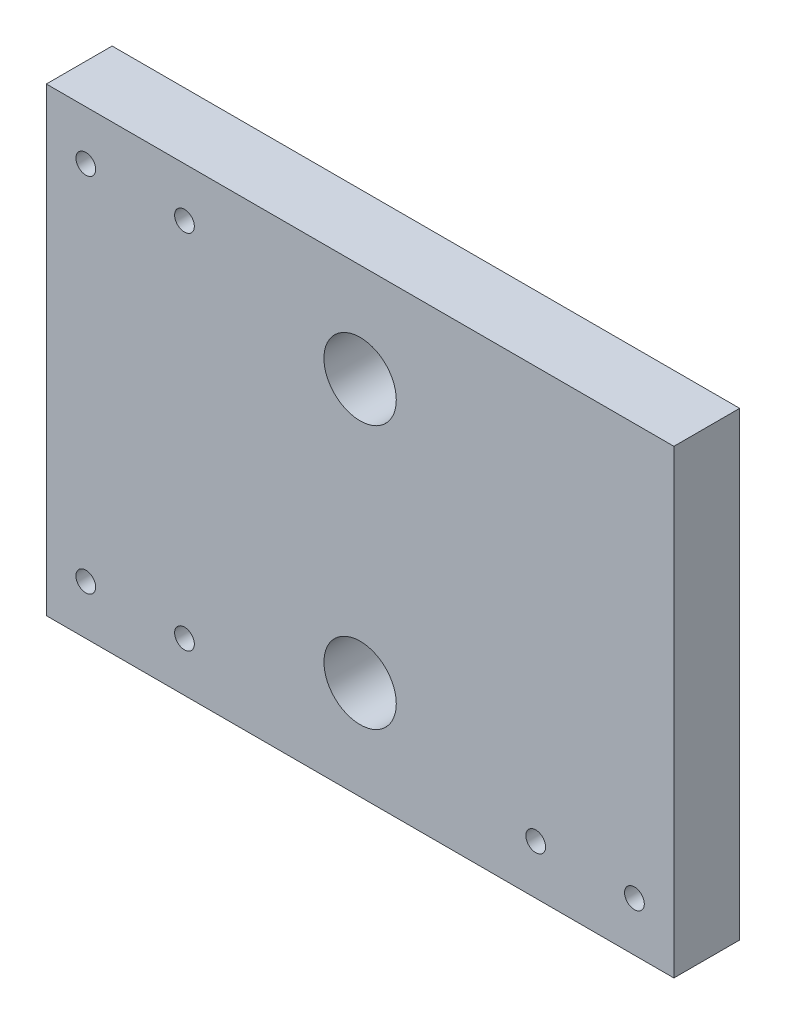
ISO-10303-21;
HEADER;
FILE_DESCRIPTION(('STEP AP214'),'2;1');
FILE_NAME('part.step','',(''),(''),'','','');
FILE_SCHEMA(('AUTOMOTIVE_DESIGN { 1 0 10303 214 1 1 1 1 }'));
ENDSEC;
DATA;
#1=APPLICATION_CONTEXT('core data for automotive mechanical design processes');
#2=APPLICATION_PROTOCOL_DEFINITION('international standard','automotive_design',2000,#1);
#3=PRODUCT_CONTEXT('',#1,'mechanical');
#4=PRODUCT('Part','Part','',(#3));
#5=PRODUCT_RELATED_PRODUCT_CATEGORY('part','',(#4));
#6=PRODUCT_DEFINITION_FORMATION('','',#4);
#7=PRODUCT_DEFINITION_CONTEXT('part definition',#1,'design');
#8=PRODUCT_DEFINITION('design','',#6,#7);
#9=PRODUCT_DEFINITION_SHAPE('','',#8);
#10=(LENGTH_UNIT() NAMED_UNIT(*) SI_UNIT(.MILLI.,.METRE.));
#11=(NAMED_UNIT(*) PLANE_ANGLE_UNIT() SI_UNIT($,.RADIAN.));
#12=(NAMED_UNIT(*) SI_UNIT($,.STERADIAN.) SOLID_ANGLE_UNIT());
#13=UNCERTAINTY_MEASURE_WITH_UNIT(LENGTH_MEASURE(1.E-05),#10,'distance_accuracy_value','');
#14=(GEOMETRIC_REPRESENTATION_CONTEXT(3) GLOBAL_UNCERTAINTY_ASSIGNED_CONTEXT((#13)) GLOBAL_UNIT_ASSIGNED_CONTEXT((#10,
#11,#12)) REPRESENTATION_CONTEXT('',''));
#15=CARTESIAN_POINT('',(0.,0.,0.));
#16=DIRECTION('',(0.,0.,1.));
#17=DIRECTION('',(1.,0.,0.));
#18=AXIS2_PLACEMENT_3D('',#15,#16,#17);
#19=CARTESIAN_POINT('',(0.,0.,10.));
#20=DIRECTION('',(0.,0.,-1.));
#21=DIRECTION('',(-1.,0.,0.));
#22=AXIS2_PLACEMENT_3D('',#19,#20,#21);
#23=CYLINDRICAL_SURFACE('',#22,7.9375);
#24=CARTESIAN_POINT('',(0.,0.,0.));
#25=DIRECTION('',(0.,0.,1.));
#26=DIRECTION('',(1.,0.,0.));
#27=AXIS2_PLACEMENT_3D('',#24,#25,#26);
#28=CIRCLE('',#27,7.9375);
#29=CARTESIAN_POINT('',(7.9375,0.,0.));
#30=VERTEX_POINT('',#29);
#31=EDGE_CURVE('E103',#30,#30,#28,.T.);
#32=ORIENTED_EDGE('',*,*,#31,.F.);
#33=EDGE_LOOP('',(#32));
#34=FACE_BOUND('',#33,.T.);
#35=CARTESIAN_POINT('',(0.,0.,2.));
#36=DIRECTION('',(0.,0.,1.));
#37=DIRECTION('',(1.,0.,0.));
#38=AXIS2_PLACEMENT_3D('',#35,#36,#37);
#39=CIRCLE('',#38,7.9375);
#40=CARTESIAN_POINT('',(7.9375,0.,2.));
#41=VERTEX_POINT('',#40);
#42=EDGE_CURVE('E320',#41,#41,#39,.T.);
#43=ORIENTED_EDGE('',*,*,#42,.T.);
#44=EDGE_LOOP('',(#43));
#45=FACE_BOUND('',#44,.T.);
#46=ADVANCED_FACE('F33',(#34,#45),#23,.F.);
#47=CARTESIAN_POINT('',(0.,40.,10.));
#48=DIRECTION('',(0.,0.,-1.));
#49=DIRECTION('',(-1.,0.,0.));
#50=AXIS2_PLACEMENT_3D('',#47,#48,#49);
#51=CYLINDRICAL_SURFACE('',#50,7.9375);
#52=CARTESIAN_POINT('',(0.,40.,0.));
#53=DIRECTION('',(0.,0.,1.));
#54=DIRECTION('',(1.,0.,0.));
#55=AXIS2_PLACEMENT_3D('',#52,#53,#54);
#56=CIRCLE('',#55,7.9375);
#57=CARTESIAN_POINT('',(7.9375,40.,0.));
#58=VERTEX_POINT('',#57);
#59=EDGE_CURVE('E111',#58,#58,#56,.T.);
#60=ORIENTED_EDGE('',*,*,#59,.F.);
#61=EDGE_LOOP('',(#60));
#62=FACE_BOUND('',#61,.T.);
#63=CARTESIAN_POINT('',(0.,40.,2.));
#64=DIRECTION('',(0.,0.,1.));
#65=DIRECTION('',(1.,0.,0.));
#66=AXIS2_PLACEMENT_3D('',#63,#64,#65);
#67=CIRCLE('',#66,7.9375);
#68=CARTESIAN_POINT('',(7.9375,40.,2.));
#69=VERTEX_POINT('',#68);
#70=EDGE_CURVE('E92',#69,#69,#67,.T.);
#71=ORIENTED_EDGE('',*,*,#70,.T.);
#72=EDGE_LOOP('',(#71));
#73=FACE_BOUND('',#72,.T.);
#74=ADVANCED_FACE('F118',(#62,#73),#51,.F.);
#75=CARTESIAN_POINT('',(0.,0.,10.));
#76=DIRECTION('',(0.,0.,1.));
#77=DIRECTION('',(1.,0.,0.));
#78=AXIS2_PLACEMENT_3D('',#75,#76,#77);
#79=PLANE('',#78);
#80=CARTESIAN_POINT('',(-41.6999999999994,-7.50000000000027,10.));
#81=DIRECTION('',(0.,0.,-1.));
#82=DIRECTION('',(-1.,0.,0.));
#83=AXIS2_PLACEMENT_3D('',#80,#81,#82);
#84=CIRCLE('',#83,1.50000000000001);
#85=CARTESIAN_POINT('',(-43.1999999999994,-7.50000000000027,10.));
#86=VERTEX_POINT('',#85);
#87=EDGE_CURVE('E284',#86,#86,#84,.T.);
#88=ORIENTED_EDGE('',*,*,#87,.T.);
#89=EDGE_LOOP('',(#88));
#90=FACE_BOUND('',#89,.T.);
#91=CARTESIAN_POINT('',(26.6999999999992,-7.50000000000027,10.));
#92=DIRECTION('',(0.,0.,-1.));
#93=DIRECTION('',(-1.,0.,0.));
#94=AXIS2_PLACEMENT_3D('',#91,#92,#93);
#95=CIRCLE('',#94,1.5);
#96=CARTESIAN_POINT('',(25.1999999999992,-7.50000000000027,10.));
#97=VERTEX_POINT('',#96);
#98=EDGE_CURVE('E310',#97,#97,#95,.T.);
#99=ORIENTED_EDGE('',*,*,#98,.T.);
#100=EDGE_LOOP('',(#99));
#101=FACE_BOUND('',#100,.T.);
#102=CARTESIAN_POINT('',(41.6999999999992,-7.50000000000026,10.));
#103=DIRECTION('',(0.,0.,-1.));
#104=DIRECTION('',(-1.,0.,0.));
#105=AXIS2_PLACEMENT_3D('',#102,#103,#104);
#106=CIRCLE('',#105,1.5);
#107=CARTESIAN_POINT('',(40.1999999999992,-7.50000000000026,10.));
#108=VERTEX_POINT('',#107);
#109=EDGE_CURVE('E304',#108,#108,#106,.T.);
#110=ORIENTED_EDGE('',*,*,#109,.T.);
#111=EDGE_LOOP('',(#110));
#112=FACE_BOUND('',#111,.T.);
#113=CARTESIAN_POINT('',(-41.6999999999993,47.5000000000021,10.));
#114=DIRECTION('',(0.,0.,-1.));
#115=DIRECTION('',(-1.,0.,0.));
#116=AXIS2_PLACEMENT_3D('',#113,#114,#115);
#117=CIRCLE('',#116,1.5);
#118=CARTESIAN_POINT('',(-43.1999999999993,47.5000000000021,10.));
#119=VERTEX_POINT('',#118);
#120=EDGE_CURVE('E297',#119,#119,#117,.T.);
#121=ORIENTED_EDGE('',*,*,#120,.T.);
#122=EDGE_LOOP('',(#121));
#123=FACE_BOUND('',#122,.T.);
#124=CARTESIAN_POINT('',(-26.6999999999994,-7.50000000000027,10.));
#125=DIRECTION('',(0.,0.,-1.));
#126=DIRECTION('',(-1.,0.,0.));
#127=AXIS2_PLACEMENT_3D('',#124,#125,#126);
#128=CIRCLE('',#127,1.5);
#129=CARTESIAN_POINT('',(-28.1999999999994,-7.50000000000027,10.));
#130=VERTEX_POINT('',#129);
#131=EDGE_CURVE('E288',#130,#130,#128,.T.);
#132=ORIENTED_EDGE('',*,*,#131,.T.);
#133=EDGE_LOOP('',(#132));
#134=FACE_BOUND('',#133,.T.);
#135=CARTESIAN_POINT('',(-26.6999999999993,47.5000000000021,10.));
#136=DIRECTION('',(0.,0.,-1.));
#137=DIRECTION('',(-1.,0.,0.));
#138=AXIS2_PLACEMENT_3D('',#135,#136,#137);
#139=CIRCLE('',#138,1.5);
#140=CARTESIAN_POINT('',(-28.1999999999993,47.5000000000021,10.));
#141=VERTEX_POINT('',#140);
#142=EDGE_CURVE('E311',#141,#141,#139,.T.);
#143=ORIENTED_EDGE('',*,*,#142,.T.);
#144=EDGE_LOOP('',(#143));
#145=FACE_BOUND('',#144,.T.);
#146=DIRECTION('',(1.,0.,0.));
#147=VECTOR('',#146,1.);
#148=CARTESIAN_POINT('',(12.5,-15.,10.));
#149=LINE('',#148,#147);
#150=CARTESIAN_POINT('',(-47.6999999999993,-15.,10.));
#151=VERTEX_POINT('',#150);
#152=CARTESIAN_POINT('',(47.6999999999993,-15.,10.));
#153=VERTEX_POINT('',#152);
#154=EDGE_CURVE('E43',#151,#153,#149,.T.);
#155=ORIENTED_EDGE('',*,*,#154,.T.);
#156=DIRECTION('',(0.,1.,0.));
#157=VECTOR('',#156,1.);
#158=CARTESIAN_POINT('',(47.6999999999993,55.,10.));
#159=LINE('',#158,#157);
#160=CARTESIAN_POINT('',(47.6999999999993,55.,10.));
#161=VERTEX_POINT('',#160);
#162=EDGE_CURVE('E75',#153,#161,#159,.T.);
#163=ORIENTED_EDGE('',*,*,#162,.T.);
#164=DIRECTION('',(-1.,0.,0.));
#165=VECTOR('',#164,1.);
#166=CARTESIAN_POINT('',(12.5,55.,10.));
#167=LINE('',#166,#165);
#168=CARTESIAN_POINT('',(-47.6999999999993,55.,10.));
#169=VERTEX_POINT('',#168);
#170=EDGE_CURVE('E11',#161,#169,#167,.T.);
#171=ORIENTED_EDGE('',*,*,#170,.T.);
#172=DIRECTION('',(0.,-1.,0.));
#173=VECTOR('',#172,1.);
#174=CARTESIAN_POINT('',(-47.6999999999993,55.,10.));
#175=LINE('',#174,#173);
#176=EDGE_CURVE('E77',#169,#151,#175,.T.);
#177=ORIENTED_EDGE('',*,*,#176,.T.);
#178=EDGE_LOOP('',(#155,#163,#171,#177));
#179=FACE_BOUND('',#178,.T.);
#180=CARTESIAN_POINT('',(0.,40.,10.));
#181=DIRECTION('',(0.,0.,1.));
#182=DIRECTION('',(1.,0.,0.));
#183=AXIS2_PLACEMENT_3D('',#180,#181,#182);
#184=CIRCLE('',#183,5.5);
#185=CARTESIAN_POINT('',(5.5,40.,10.));
#186=VERTEX_POINT('',#185);
#187=EDGE_CURVE('E325',#186,#186,#184,.T.);
#188=ORIENTED_EDGE('',*,*,#187,.F.);
#189=EDGE_LOOP('',(#188));
#190=FACE_BOUND('',#189,.T.);
#191=CARTESIAN_POINT('',(0.,0.,10.));
#192=DIRECTION('',(0.,0.,1.));
#193=DIRECTION('',(1.,0.,0.));
#194=AXIS2_PLACEMENT_3D('',#191,#192,#193);
#195=CIRCLE('',#194,5.5);
#196=CARTESIAN_POINT('',(5.5,0.,10.));
#197=VERTEX_POINT('',#196);
#198=EDGE_CURVE('E314',#197,#197,#195,.T.);
#199=ORIENTED_EDGE('',*,*,#198,.F.);
#200=EDGE_LOOP('',(#199));
#201=FACE_BOUND('',#200,.T.);
#202=ADVANCED_FACE('F72',(#90,#101,#112,#123,#134,#145,#179,#190,#201),#79,.T.);
#203=CARTESIAN_POINT('',(0.,0.,0.));
#204=DIRECTION('',(0.,0.,1.));
#205=DIRECTION('',(1.,0.,0.));
#206=AXIS2_PLACEMENT_3D('',#203,#204,#205);
#207=PLANE('',#206);
#208=CARTESIAN_POINT('',(-41.6999999999994,-7.50000000000027,0.));
#209=DIRECTION('',(0.,0.,-1.));
#210=DIRECTION('',(-1.,0.,0.));
#211=AXIS2_PLACEMENT_3D('',#208,#209,#210);
#212=CIRCLE('',#211,1.50000000000001);
#213=CARTESIAN_POINT('',(-43.1999999999994,-7.50000000000027,0.));
#214=VERTEX_POINT('',#213);
#215=EDGE_CURVE('E287',#214,#214,#212,.T.);
#216=ORIENTED_EDGE('',*,*,#215,.F.);
#217=EDGE_LOOP('',(#216));
#218=FACE_BOUND('',#217,.T.);
#219=CARTESIAN_POINT('',(26.6999999999992,-7.50000000000027,0.));
#220=DIRECTION('',(0.,0.,-1.));
#221=DIRECTION('',(-1.,0.,0.));
#222=AXIS2_PLACEMENT_3D('',#219,#220,#221);
#223=CIRCLE('',#222,1.5);
#224=CARTESIAN_POINT('',(25.1999999999992,-7.50000000000027,0.));
#225=VERTEX_POINT('',#224);
#226=EDGE_CURVE('E290',#225,#225,#223,.T.);
#227=ORIENTED_EDGE('',*,*,#226,.F.);
#228=EDGE_LOOP('',(#227));
#229=FACE_BOUND('',#228,.T.);
#230=CARTESIAN_POINT('',(41.6999999999992,-7.50000000000026,0.));
#231=DIRECTION('',(0.,0.,-1.));
#232=DIRECTION('',(-1.,0.,0.));
#233=AXIS2_PLACEMENT_3D('',#230,#231,#232);
#234=CIRCLE('',#233,1.5);
#235=CARTESIAN_POINT('',(40.1999999999992,-7.50000000000026,0.));
#236=VERTEX_POINT('',#235);
#237=EDGE_CURVE('E307',#236,#236,#234,.T.);
#238=ORIENTED_EDGE('',*,*,#237,.F.);
#239=EDGE_LOOP('',(#238));
#240=FACE_BOUND('',#239,.T.);
#241=CARTESIAN_POINT('',(-41.6999999999993,47.5000000000021,0.));
#242=DIRECTION('',(0.,0.,-1.));
#243=DIRECTION('',(-1.,0.,0.));
#244=AXIS2_PLACEMENT_3D('',#241,#242,#243);
#245=CIRCLE('',#244,1.5);
#246=CARTESIAN_POINT('',(-43.1999999999993,47.5000000000021,0.));
#247=VERTEX_POINT('',#246);
#248=EDGE_CURVE('E301',#247,#247,#245,.T.);
#249=ORIENTED_EDGE('',*,*,#248,.F.);
#250=EDGE_LOOP('',(#249));
#251=FACE_BOUND('',#250,.T.);
#252=CARTESIAN_POINT('',(-26.6999999999994,-7.50000000000027,0.));
#253=DIRECTION('',(0.,0.,-1.));
#254=DIRECTION('',(-1.,0.,0.));
#255=AXIS2_PLACEMENT_3D('',#252,#253,#254);
#256=CIRCLE('',#255,1.5);
#257=CARTESIAN_POINT('',(-28.1999999999994,-7.50000000000027,0.));
#258=VERTEX_POINT('',#257);
#259=EDGE_CURVE('E293',#258,#258,#256,.T.);
#260=ORIENTED_EDGE('',*,*,#259,.F.);
#261=EDGE_LOOP('',(#260));
#262=FACE_BOUND('',#261,.T.);
#263=CARTESIAN_POINT('',(-26.6999999999993,47.5000000000021,0.));
#264=DIRECTION('',(0.,0.,-1.));
#265=DIRECTION('',(-1.,0.,0.));
#266=AXIS2_PLACEMENT_3D('',#263,#264,#265);
#267=CIRCLE('',#266,1.5);
#268=CARTESIAN_POINT('',(-28.1999999999993,47.5000000000021,0.));
#269=VERTEX_POINT('',#268);
#270=EDGE_CURVE('E300',#269,#269,#267,.T.);
#271=ORIENTED_EDGE('',*,*,#270,.F.);
#272=EDGE_LOOP('',(#271));
#273=FACE_BOUND('',#272,.T.);
#274=DIRECTION('',(0.,1.,0.));
#275=VECTOR('',#274,1.);
#276=CARTESIAN_POINT('',(-47.6999999999993,55.,0.));
#277=LINE('',#276,#275);
#278=CARTESIAN_POINT('',(-47.6999999999993,-15.,0.));
#279=VERTEX_POINT('',#278);
#280=CARTESIAN_POINT('',(-47.6999999999993,55.,0.));
#281=VERTEX_POINT('',#280);
#282=EDGE_CURVE('E101',#279,#281,#277,.T.);
#283=ORIENTED_EDGE('',*,*,#282,.T.);
#284=DIRECTION('',(-1.,0.,0.));
#285=VECTOR('',#284,1.);
#286=CARTESIAN_POINT('',(12.5,55.,0.));
#287=LINE('',#286,#285);
#288=CARTESIAN_POINT('',(47.6999999999993,55.,0.));
#289=VERTEX_POINT('',#288);
#290=EDGE_CURVE('E37',#289,#281,#287,.T.);
#291=ORIENTED_EDGE('',*,*,#290,.F.);
#292=DIRECTION('',(0.,-1.,0.));
#293=VECTOR('',#292,1.);
#294=CARTESIAN_POINT('',(47.6999999999993,55.,0.));
#295=LINE('',#294,#293);
#296=CARTESIAN_POINT('',(47.6999999999993,-15.,0.));
#297=VERTEX_POINT('',#296);
#298=EDGE_CURVE('E99',#289,#297,#295,.T.);
#299=ORIENTED_EDGE('',*,*,#298,.T.);
#300=DIRECTION('',(1.,0.,0.));
#301=VECTOR('',#300,1.);
#302=CARTESIAN_POINT('',(12.5,-15.,0.));
#303=LINE('',#302,#301);
#304=EDGE_CURVE('E84',#279,#297,#303,.T.);
#305=ORIENTED_EDGE('',*,*,#304,.F.);
#306=EDGE_LOOP('',(#283,#291,#299,#305));
#307=FACE_BOUND('',#306,.T.);
#308=ORIENTED_EDGE('',*,*,#59,.T.);
#309=EDGE_LOOP('',(#308));
#310=FACE_BOUND('',#309,.T.);
#311=ORIENTED_EDGE('',*,*,#31,.T.);
#312=EDGE_LOOP('',(#311));
#313=FACE_BOUND('',#312,.T.);
#314=ADVANCED_FACE('F115',(#218,#229,#240,#251,#262,#273,#307,#310,#313),#207,.F.);
#315=CARTESIAN_POINT('',(12.5,-15.,10.));
#316=DIRECTION('',(0.,1.,0.));
#317=DIRECTION('',(-1.,0.,0.));
#318=AXIS2_PLACEMENT_3D('',#315,#316,#317);
#319=PLANE('',#318);
#320=ORIENTED_EDGE('',*,*,#304,.T.);
#321=DIRECTION('',(0.,0.,1.));
#322=VECTOR('',#321,1.);
#323=CARTESIAN_POINT('',(47.6999999999993,-15.,-80.3756804014743));
#324=LINE('',#323,#322);
#325=EDGE_CURVE('E83',#297,#153,#324,.T.);
#326=ORIENTED_EDGE('',*,*,#325,.T.);
#327=ORIENTED_EDGE('',*,*,#154,.F.);
#328=DIRECTION('',(0.,0.,1.));
#329=VECTOR('',#328,1.);
#330=CARTESIAN_POINT('',(-47.6999999999993,-15.,-80.3756804014743));
#331=LINE('',#330,#329);
#332=EDGE_CURVE('E104',#279,#151,#331,.T.);
#333=ORIENTED_EDGE('',*,*,#332,.F.);
#334=EDGE_LOOP('',(#320,#326,#327,#333));
#335=FACE_BOUND('',#334,.T.);
#336=ADVANCED_FACE('F35',(#335),#319,.F.);
#337=CARTESIAN_POINT('',(12.5,55.,10.));
#338=DIRECTION('',(0.,-1.,0.));
#339=DIRECTION('',(0.,0.,-1.));
#340=AXIS2_PLACEMENT_3D('',#337,#338,#339);
#341=PLANE('',#340);
#342=DIRECTION('',(0.,0.,1.));
#343=VECTOR('',#342,1.);
#344=CARTESIAN_POINT('',(-47.6999999999993,55.,-80.3756804014743));
#345=LINE('',#344,#343);
#346=EDGE_CURVE('E106',#281,#169,#345,.T.);
#347=ORIENTED_EDGE('',*,*,#346,.T.);
#348=ORIENTED_EDGE('',*,*,#170,.F.);
#349=DIRECTION('',(0.,0.,1.));
#350=VECTOR('',#349,1.);
#351=CARTESIAN_POINT('',(47.6999999999993,55.,-80.3756804014743));
#352=LINE('',#351,#350);
#353=EDGE_CURVE('E88',#289,#161,#352,.T.);
#354=ORIENTED_EDGE('',*,*,#353,.F.);
#355=ORIENTED_EDGE('',*,*,#290,.T.);
#356=EDGE_LOOP('',(#347,#348,#354,#355));
#357=FACE_BOUND('',#356,.T.);
#358=ADVANCED_FACE('F153',(#357),#341,.F.);
#359=CARTESIAN_POINT('',(-47.6999999999993,55.,-80.3756804014743));
#360=DIRECTION('',(-1.,0.,0.));
#361=DIRECTION('',(0.,-1.,0.));
#362=AXIS2_PLACEMENT_3D('',#359,#360,#361);
#363=PLANE('',#362);
#364=ORIENTED_EDGE('',*,*,#282,.F.);
#365=ORIENTED_EDGE('',*,*,#332,.T.);
#366=ORIENTED_EDGE('',*,*,#176,.F.);
#367=ORIENTED_EDGE('',*,*,#346,.F.);
#368=EDGE_LOOP('',(#364,#365,#366,#367));
#369=FACE_BOUND('',#368,.T.);
#370=ADVANCED_FACE('F136',(#369),#363,.T.);
#371=CARTESIAN_POINT('',(47.6999999999993,55.,-80.3756804014743));
#372=DIRECTION('',(1.,0.,0.));
#373=DIRECTION('',(0.,1.,0.));
#374=AXIS2_PLACEMENT_3D('',#371,#372,#373);
#375=PLANE('',#374);
#376=ORIENTED_EDGE('',*,*,#298,.F.);
#377=ORIENTED_EDGE('',*,*,#353,.T.);
#378=ORIENTED_EDGE('',*,*,#162,.F.);
#379=ORIENTED_EDGE('',*,*,#325,.F.);
#380=EDGE_LOOP('',(#376,#377,#378,#379));
#381=FACE_BOUND('',#380,.T.);
#382=ADVANCED_FACE('F91',(#381),#375,.T.);
#383=CARTESIAN_POINT('',(0.,40.,2.));
#384=DIRECTION('',(0.,0.,1.));
#385=DIRECTION('',(1.,0.,0.));
#386=AXIS2_PLACEMENT_3D('',#383,#384,#385);
#387=PLANE('',#386);
#388=CARTESIAN_POINT('',(0.,40.,2.));
#389=DIRECTION('',(0.,0.,1.));
#390=DIRECTION('',(1.,0.,0.));
#391=AXIS2_PLACEMENT_3D('',#388,#389,#390);
#392=CIRCLE('',#391,5.5);
#393=CARTESIAN_POINT('',(5.5,40.,2.));
#394=VERTEX_POINT('',#393);
#395=EDGE_CURVE('E95',#394,#394,#392,.T.);
#396=ORIENTED_EDGE('',*,*,#395,.T.);
#397=EDGE_LOOP('',(#396));
#398=FACE_BOUND('',#397,.T.);
#399=ORIENTED_EDGE('',*,*,#70,.F.);
#400=EDGE_LOOP('',(#399));
#401=FACE_BOUND('',#400,.T.);
#402=ADVANCED_FACE('F124',(#398,#401),#387,.F.);
#403=CARTESIAN_POINT('',(0.,40.,2.));
#404=DIRECTION('',(0.,0.,1.));
#405=DIRECTION('',(1.,0.,0.));
#406=AXIS2_PLACEMENT_3D('',#403,#404,#405);
#407=CYLINDRICAL_SURFACE('',#406,5.5);
#408=ORIENTED_EDGE('',*,*,#395,.F.);
#409=EDGE_LOOP('',(#408));
#410=FACE_BOUND('',#409,.T.);
#411=ORIENTED_EDGE('',*,*,#187,.T.);
#412=EDGE_LOOP('',(#411));
#413=FACE_BOUND('',#412,.T.);
#414=ADVANCED_FACE('F126',(#410,#413),#407,.F.);
#415=CARTESIAN_POINT('',(0.,0.,2.));
#416=DIRECTION('',(0.,0.,1.));
#417=DIRECTION('',(1.,0.,0.));
#418=AXIS2_PLACEMENT_3D('',#415,#416,#417);
#419=PLANE('',#418);
#420=CARTESIAN_POINT('',(0.,0.,2.));
#421=DIRECTION('',(0.,0.,1.));
#422=DIRECTION('',(1.,0.,0.));
#423=AXIS2_PLACEMENT_3D('',#420,#421,#422);
#424=CIRCLE('',#423,5.5);
#425=CARTESIAN_POINT('',(5.5,0.,2.));
#426=VERTEX_POINT('',#425);
#427=EDGE_CURVE('E317',#426,#426,#424,.T.);
#428=ORIENTED_EDGE('',*,*,#427,.T.);
#429=EDGE_LOOP('',(#428));
#430=FACE_BOUND('',#429,.T.);
#431=ORIENTED_EDGE('',*,*,#42,.F.);
#432=EDGE_LOOP('',(#431));
#433=FACE_BOUND('',#432,.T.);
#434=ADVANCED_FACE('F133',(#430,#433),#419,.F.);
#435=CARTESIAN_POINT('',(0.,0.,2.));
#436=DIRECTION('',(0.,0.,1.));
#437=DIRECTION('',(1.,0.,0.));
#438=AXIS2_PLACEMENT_3D('',#435,#436,#437);
#439=CYLINDRICAL_SURFACE('',#438,5.5);
#440=ORIENTED_EDGE('',*,*,#427,.F.);
#441=EDGE_LOOP('',(#440));
#442=FACE_BOUND('',#441,.T.);
#443=ORIENTED_EDGE('',*,*,#198,.T.);
#444=EDGE_LOOP('',(#443));
#445=FACE_BOUND('',#444,.T.);
#446=ADVANCED_FACE('F208',(#442,#445),#439,.F.);
#447=CARTESIAN_POINT('',(-26.6999999999993,47.5000000000021,10.));
#448=DIRECTION('',(0.,0.,-1.));
#449=DIRECTION('',(-1.,0.,0.));
#450=AXIS2_PLACEMENT_3D('',#447,#448,#449);
#451=CYLINDRICAL_SURFACE('',#450,1.5);
#452=ORIENTED_EDGE('',*,*,#142,.F.);
#453=EDGE_LOOP('',(#452));
#454=FACE_BOUND('',#453,.T.);
#455=ORIENTED_EDGE('',*,*,#270,.T.);
#456=EDGE_LOOP('',(#455));
#457=FACE_BOUND('',#456,.T.);
#458=ADVANCED_FACE('F217',(#454,#457),#451,.F.);
#459=CARTESIAN_POINT('',(-26.6999999999994,-7.50000000000027,10.));
#460=DIRECTION('',(0.,0.,-1.));
#461=DIRECTION('',(-1.,0.,0.));
#462=AXIS2_PLACEMENT_3D('',#459,#460,#461);
#463=CYLINDRICAL_SURFACE('',#462,1.5);
#464=ORIENTED_EDGE('',*,*,#131,.F.);
#465=EDGE_LOOP('',(#464));
#466=FACE_BOUND('',#465,.T.);
#467=ORIENTED_EDGE('',*,*,#259,.T.);
#468=EDGE_LOOP('',(#467));
#469=FACE_BOUND('',#468,.T.);
#470=ADVANCED_FACE('F227',(#466,#469),#463,.F.);
#471=CARTESIAN_POINT('',(-41.6999999999993,47.5000000000021,10.));
#472=DIRECTION('',(0.,0.,-1.));
#473=DIRECTION('',(-1.,0.,0.));
#474=AXIS2_PLACEMENT_3D('',#471,#472,#473);
#475=CYLINDRICAL_SURFACE('',#474,1.5);
#476=ORIENTED_EDGE('',*,*,#120,.F.);
#477=EDGE_LOOP('',(#476));
#478=FACE_BOUND('',#477,.T.);
#479=ORIENTED_EDGE('',*,*,#248,.T.);
#480=EDGE_LOOP('',(#479));
#481=FACE_BOUND('',#480,.T.);
#482=ADVANCED_FACE('F234',(#478,#481),#475,.F.);
#483=CARTESIAN_POINT('',(41.6999999999992,-7.50000000000026,10.));
#484=DIRECTION('',(0.,0.,-1.));
#485=DIRECTION('',(-1.,0.,0.));
#486=AXIS2_PLACEMENT_3D('',#483,#484,#485);
#487=CYLINDRICAL_SURFACE('',#486,1.5);
#488=ORIENTED_EDGE('',*,*,#109,.F.);
#489=EDGE_LOOP('',(#488));
#490=FACE_BOUND('',#489,.T.);
#491=ORIENTED_EDGE('',*,*,#237,.T.);
#492=EDGE_LOOP('',(#491));
#493=FACE_BOUND('',#492,.T.);
#494=ADVANCED_FACE('F242',(#490,#493),#487,.F.);
#495=CARTESIAN_POINT('',(26.6999999999992,-7.50000000000027,10.));
#496=DIRECTION('',(0.,0.,-1.));
#497=DIRECTION('',(-1.,0.,0.));
#498=AXIS2_PLACEMENT_3D('',#495,#496,#497);
#499=CYLINDRICAL_SURFACE('',#498,1.5);
#500=ORIENTED_EDGE('',*,*,#98,.F.);
#501=EDGE_LOOP('',(#500));
#502=FACE_BOUND('',#501,.T.);
#503=ORIENTED_EDGE('',*,*,#226,.T.);
#504=EDGE_LOOP('',(#503));
#505=FACE_BOUND('',#504,.T.);
#506=ADVANCED_FACE('F250',(#502,#505),#499,.F.);
#507=CARTESIAN_POINT('',(-41.6999999999994,-7.50000000000027,10.));
#508=DIRECTION('',(0.,0.,-1.));
#509=DIRECTION('',(-1.,0.,0.));
#510=AXIS2_PLACEMENT_3D('',#507,#508,#509);
#511=CYLINDRICAL_SURFACE('',#510,1.50000000000001);
#512=ORIENTED_EDGE('',*,*,#87,.F.);
#513=EDGE_LOOP('',(#512));
#514=FACE_BOUND('',#513,.T.);
#515=ORIENTED_EDGE('',*,*,#215,.T.);
#516=EDGE_LOOP('',(#515));
#517=FACE_BOUND('',#516,.T.);
#518=ADVANCED_FACE('F258',(#514,#517),#511,.F.);
#519=CLOSED_SHELL('',(#46,#74,#202,#314,#336,#358,#370,#382,#402,#414,#434,#446,#458,#470,#482,
#494,#506,#518));
#520=MANIFOLD_SOLID_BREP('B2',#519);
#521=ADVANCED_BREP_SHAPE_REPRESENTATION('',(#18,#520),#14);
#522=SHAPE_DEFINITION_REPRESENTATION(#9,#521);
ENDSEC;
END-ISO-10303-21;
